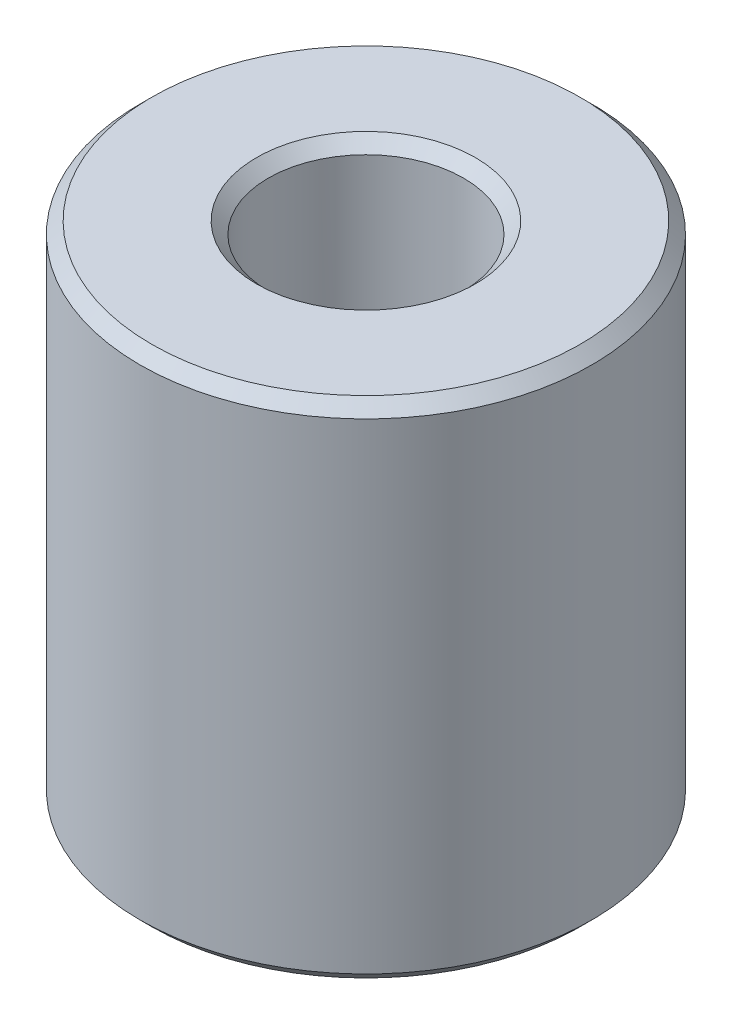
ISO-10303-21;
HEADER;
FILE_DESCRIPTION(('STEP AP214'),'2;1');
FILE_NAME('part.step','',(''),(''),'','','');
FILE_SCHEMA(('AUTOMOTIVE_DESIGN { 1 0 10303 214 1 1 1 1 }'));
ENDSEC;
DATA;
#1=APPLICATION_CONTEXT('core data for automotive mechanical design processes');
#2=APPLICATION_PROTOCOL_DEFINITION('international standard','automotive_design',2000,#1);
#3=PRODUCT_CONTEXT('',#1,'mechanical');
#4=PRODUCT('Part','Part','',(#3));
#5=PRODUCT_RELATED_PRODUCT_CATEGORY('part','',(#4));
#6=PRODUCT_DEFINITION_FORMATION('','',#4);
#7=PRODUCT_DEFINITION_CONTEXT('part definition',#1,'design');
#8=PRODUCT_DEFINITION('design','',#6,#7);
#9=PRODUCT_DEFINITION_SHAPE('','',#8);
#10=(LENGTH_UNIT() NAMED_UNIT(*) SI_UNIT(.MILLI.,.METRE.));
#11=(NAMED_UNIT(*) PLANE_ANGLE_UNIT() SI_UNIT($,.RADIAN.));
#12=(NAMED_UNIT(*) SI_UNIT($,.STERADIAN.) SOLID_ANGLE_UNIT());
#13=UNCERTAINTY_MEASURE_WITH_UNIT(LENGTH_MEASURE(1.E-05),#10,'distance_accuracy_value','');
#14=(GEOMETRIC_REPRESENTATION_CONTEXT(3) GLOBAL_UNCERTAINTY_ASSIGNED_CONTEXT((#13)) GLOBAL_UNIT_ASSIGNED_CONTEXT((#10,
#11,#12)) REPRESENTATION_CONTEXT('',''));
#15=CARTESIAN_POINT('',(0.,0.,0.));
#16=DIRECTION('',(0.,0.,1.));
#17=DIRECTION('',(1.,0.,0.));
#18=AXIS2_PLACEMENT_3D('',#15,#16,#17);
#19=CARTESIAN_POINT('',(0.,33.4799915856072,0.));
#20=DIRECTION('',(0.,-1.,0.));
#21=DIRECTION('',(0.,0.,-1.));
#22=AXIS2_PLACEMENT_3D('',#19,#20,#21);
#23=CYLINDRICAL_SURFACE('',#22,15.);
#24=CARTESIAN_POINT('',(0.,0.785728698125668,0.));
#25=DIRECTION('',(0.,1.,0.));
#26=DIRECTION('',(0.,0.,1.));
#27=AXIS2_PLACEMENT_3D('',#24,#25,#26);
#28=CIRCLE('',#27,15.);
#29=CARTESIAN_POINT('',(0.,0.785728698125668,15.));
#30=VERTEX_POINT('',#29);
#31=EDGE_CURVE('E10',#30,#30,#28,.T.);
#32=ORIENTED_EDGE('',*,*,#31,.T.);
#33=EDGE_LOOP('',(#32));
#34=FACE_BOUND('',#33,.T.);
#35=CARTESIAN_POINT('',(0.,32.6942628874815,0.));
#36=DIRECTION('',(0.,1.,0.));
#37=DIRECTION('',(0.,0.,1.));
#38=AXIS2_PLACEMENT_3D('',#35,#36,#37);
#39=CIRCLE('',#38,15.);
#40=CARTESIAN_POINT('',(0.,32.6942628874815,15.));
#41=VERTEX_POINT('',#40);
#42=EDGE_CURVE('E50',#41,#41,#39,.F.);
#43=ORIENTED_EDGE('',*,*,#42,.T.);
#44=EDGE_LOOP('',(#43));
#45=FACE_BOUND('',#44,.T.);
#46=ADVANCED_FACE('F39',(#34,#45),#23,.T.);
#47=CARTESIAN_POINT('',(0.,33.4799915856072,0.));
#48=DIRECTION('',(0.,1.,0.));
#49=DIRECTION('',(0.,0.,1.));
#50=AXIS2_PLACEMENT_3D('',#47,#48,#49);
#51=PLANE('',#50);
#52=CARTESIAN_POINT('',(0.,33.4799915856072,0.));
#53=DIRECTION('',(0.,1.,0.));
#54=DIRECTION('',(0.,0.,1.));
#55=AXIS2_PLACEMENT_3D('',#52,#53,#54);
#56=CIRCLE('',#55,7.26731428552265);
#57=CARTESIAN_POINT('',(0.,33.4799915856072,7.26731428552265));
#58=VERTEX_POINT('',#57);
#59=EDGE_CURVE('E58',#58,#58,#56,.F.);
#60=ORIENTED_EDGE('',*,*,#59,.T.);
#61=EDGE_LOOP('',(#60));
#62=FACE_BOUND('',#61,.T.);
#63=CARTESIAN_POINT('',(0.,33.4799915856072,0.));
#64=DIRECTION('',(0.,1.,0.));
#65=DIRECTION('',(0.,0.,1.));
#66=AXIS2_PLACEMENT_3D('',#63,#64,#65);
#67=CIRCLE('',#66,14.2142713018743);
#68=CARTESIAN_POINT('',(0.,33.4799915856072,14.2142713018743));
#69=VERTEX_POINT('',#68);
#70=EDGE_CURVE('E61',#69,#69,#67,.T.);
#71=ORIENTED_EDGE('',*,*,#70,.T.);
#72=EDGE_LOOP('',(#71));
#73=FACE_BOUND('',#72,.T.);
#74=ADVANCED_FACE('F88',(#62,#73),#51,.T.);
#75=CARTESIAN_POINT('',(0.,0.,0.));
#76=DIRECTION('',(0.,1.,0.));
#77=DIRECTION('',(0.,0.,1.));
#78=AXIS2_PLACEMENT_3D('',#75,#76,#77);
#79=PLANE('',#78);
#80=CARTESIAN_POINT('',(0.,0.,0.));
#81=DIRECTION('',(0.,1.,0.));
#82=DIRECTION('',(0.,0.,1.));
#83=AXIS2_PLACEMENT_3D('',#80,#81,#82);
#84=CIRCLE('',#83,7.26731428552266);
#85=CARTESIAN_POINT('',(0.,0.,-7.26731428552266));
#86=VERTEX_POINT('',#85);
#87=EDGE_CURVE('E51',#86,#86,#84,.T.);
#88=ORIENTED_EDGE('',*,*,#87,.T.);
#89=EDGE_LOOP('',(#88));
#90=FACE_BOUND('',#89,.T.);
#91=CARTESIAN_POINT('',(0.,0.,0.));
#92=DIRECTION('',(0.,1.,0.));
#93=DIRECTION('',(0.,0.,1.));
#94=AXIS2_PLACEMENT_3D('',#91,#92,#93);
#95=CIRCLE('',#94,14.2142713018743);
#96=CARTESIAN_POINT('',(0.,0.,14.2142713018743));
#97=VERTEX_POINT('',#96);
#98=EDGE_CURVE('E54',#97,#97,#95,.F.);
#99=ORIENTED_EDGE('',*,*,#98,.T.);
#100=EDGE_LOOP('',(#99));
#101=FACE_BOUND('',#100,.T.);
#102=ADVANCED_FACE('F83',(#90,#101),#79,.F.);
#103=CARTESIAN_POINT('',(0.,33.4799915856072,0.));
#104=DIRECTION('',(0.,-1.,0.));
#105=DIRECTION('',(0.,0.,-1.));
#106=AXIS2_PLACEMENT_3D('',#103,#104,#105);
#107=CYLINDRICAL_SURFACE('',#106,6.48158558739699);
#108=CARTESIAN_POINT('',(0.,32.6942628874815,0.));
#109=DIRECTION('',(0.,1.,0.));
#110=DIRECTION('',(0.,0.,1.));
#111=AXIS2_PLACEMENT_3D('',#108,#109,#110);
#112=CIRCLE('',#111,6.48158558739699);
#113=CARTESIAN_POINT('',(0.,32.6942628874815,6.48158558739699));
#114=VERTEX_POINT('',#113);
#115=EDGE_CURVE('E67',#114,#114,#112,.T.);
#116=ORIENTED_EDGE('',*,*,#115,.T.);
#117=EDGE_LOOP('',(#116));
#118=FACE_BOUND('',#117,.T.);
#119=CARTESIAN_POINT('',(0.,0.785728698125675,0.));
#120=DIRECTION('',(0.,1.,0.));
#121=DIRECTION('',(0.,0.,1.));
#122=AXIS2_PLACEMENT_3D('',#119,#120,#121);
#123=CIRCLE('',#122,6.48158558739699);
#124=CARTESIAN_POINT('',(0.,0.785728698125675,-6.48158558739699));
#125=VERTEX_POINT('',#124);
#126=EDGE_CURVE('E69',#125,#125,#123,.F.);
#127=ORIENTED_EDGE('',*,*,#126,.T.);
#128=EDGE_LOOP('',(#127));
#129=FACE_BOUND('',#128,.T.);
#130=ADVANCED_FACE('F71',(#118,#129),#107,.F.);
#131=CARTESIAN_POINT('',(0.,32.6942628874815,0.));
#132=DIRECTION('',(0.,1.,0.));
#133=DIRECTION('',(0.,0.,1.));
#134=AXIS2_PLACEMENT_3D('',#131,#132,#133);
#135=CONICAL_SURFACE('',#134,6.48158558739699,0.785398163397449);
#136=ORIENTED_EDGE('',*,*,#59,.F.);
#137=EDGE_LOOP('',(#136));
#138=FACE_BOUND('',#137,.T.);
#139=ORIENTED_EDGE('',*,*,#115,.F.);
#140=EDGE_LOOP('',(#139));
#141=FACE_BOUND('',#140,.T.);
#142=ADVANCED_FACE('F77',(#138,#141),#135,.F.);
#143=CARTESIAN_POINT('',(0.,0.,0.));
#144=DIRECTION('',(0.,-1.,0.));
#145=DIRECTION('',(0.,0.,-1.));
#146=AXIS2_PLACEMENT_3D('',#143,#144,#145);
#147=CONICAL_SURFACE('',#146,7.26731428552266,0.785398163397445);
#148=CARTESIAN_POINT('',(0.,0.785728698125675,-6.48158558739699));
#149=CARTESIAN_POINT('',(0.,0.777544024186866,-6.4897702613358));
#150=CARTESIAN_POINT('',(0.,0.769359350248057,-6.49795493527461));
#151=CARTESIAN_POINT('',(0.,0.752990002370438,-6.51432428315223));
#152=CARTESIAN_POINT('',(0.,0.744805328431629,-6.52250895709104));
#153=CARTESIAN_POINT('',(0.,0.728435980554011,-6.53887830496865));
#154=CARTESIAN_POINT('',(0.,0.720251306615202,-6.54706297890746));
#155=CARTESIAN_POINT('',(0.,0.703881958737584,-6.56343232678508));
#156=CARTESIAN_POINT('',(0.,0.695697284798774,-6.57161700072389));
#157=CARTESIAN_POINT('',(0.,0.679327936921156,-6.58798634860151));
#158=CARTESIAN_POINT('',(0.,0.671143262982347,-6.59617102254032));
#159=CARTESIAN_POINT('',(0.,0.654773915104729,-6.61254037041793));
#160=CARTESIAN_POINT('',(0.,0.64658924116592,-6.62072504435674));
#161=CARTESIAN_POINT('',(0.,0.630219893288301,-6.63709439223436));
#162=CARTESIAN_POINT('',(0.,0.622035219349492,-6.64527906617317));
#163=CARTESIAN_POINT('',(0.,0.605665871471874,-6.66164841405079));
#164=CARTESIAN_POINT('',(0.,0.597481197533065,-6.6698330879896));
#165=CARTESIAN_POINT('',(0.,0.581111849655447,-6.68620243586722));
#166=CARTESIAN_POINT('',(0.,0.572927175716638,-6.69438710980602));
#167=CARTESIAN_POINT('',(0.,0.556557827839019,-6.71075645768364));
#168=CARTESIAN_POINT('',(0.,0.54837315390021,-6.71894113162245));
#169=CARTESIAN_POINT('',(0.,0.532003806022592,-6.73531047950007));
#170=CARTESIAN_POINT('',(0.,0.523819132083783,-6.74349515343888));
#171=CARTESIAN_POINT('',(0.,0.507449784206165,-6.7598645013165));
#172=CARTESIAN_POINT('',(0.,0.499265110267356,-6.76804917525531));
#173=CARTESIAN_POINT('',(0.,0.482895762389738,-6.78441852313292));
#174=CARTESIAN_POINT('',(0.,0.474711088450928,-6.79260319707173));
#175=CARTESIAN_POINT('',(0.,0.45834174057331,-6.80897254494935));
#176=CARTESIAN_POINT('',(0.,0.450157066634501,-6.81715721888816));
#177=CARTESIAN_POINT('',(0.,0.433787718756883,-6.83352656676578));
#178=CARTESIAN_POINT('',(0.,0.425603044818074,-6.84171124070459));
#179=CARTESIAN_POINT('',(0.,0.409233696940455,-6.85808058858221));
#180=CARTESIAN_POINT('',(0.,0.401049023001646,-6.86626526252101));
#181=CARTESIAN_POINT('',(0.,0.384679675124028,-6.88263461039863));
#182=CARTESIAN_POINT('',(0.,0.376495001185219,-6.89081928433744));
#183=CARTESIAN_POINT('',(0.,0.360125653307601,-6.90718863221506));
#184=CARTESIAN_POINT('',(0.,0.351940979368792,-6.91537330615387));
#185=CARTESIAN_POINT('',(0.,0.335571631491173,-6.93174265403149));
#186=CARTESIAN_POINT('',(0.,0.327386957552364,-6.9399273279703));
#187=CARTESIAN_POINT('',(0.,0.311017609674746,-6.95629667584791));
#188=CARTESIAN_POINT('',(0.,0.302832935735937,-6.96448134978672));
#189=CARTESIAN_POINT('',(0.,0.286463587858319,-6.98085069766434));
#190=CARTESIAN_POINT('',(0.,0.27827891391951,-6.98903537160315));
#191=CARTESIAN_POINT('',(0.,0.261909566041892,-7.00540471948077));
#192=CARTESIAN_POINT('',(0.,0.253724892103082,-7.01358939341958));
#193=CARTESIAN_POINT('',(0.,0.237355544225464,-7.0299587412972));
#194=CARTESIAN_POINT('',(0.,0.229170870286655,-7.03814341523601));
#195=CARTESIAN_POINT('',(0.,0.212801522409037,-7.05451276311362));
#196=CARTESIAN_POINT('',(0.,0.204616848470228,-7.06269743705243));
#197=CARTESIAN_POINT('',(0.,0.188247500592609,-7.07906678493005));
#198=CARTESIAN_POINT('',(0.,0.1800628266538,-7.08725145886886));
#199=CARTESIAN_POINT('',(0.,0.163693478776182,-7.10362080674648));
#200=CARTESIAN_POINT('',(0.,0.155508804837373,-7.11180548068529));
#201=CARTESIAN_POINT('',(0.,0.139139456959755,-7.1281748285629));
#202=CARTESIAN_POINT('',(0.,0.130954783020946,-7.13635950250171));
#203=CARTESIAN_POINT('',(0.,0.114585435143327,-7.15272885037933));
#204=CARTESIAN_POINT('',(0.,0.106400761204519,-7.16091352431814));
#205=CARTESIAN_POINT('',(0.,0.0900314133269003,-7.17728287219576));
#206=CARTESIAN_POINT('',(0.,0.081846739388091,-7.18546754613457));
#207=CARTESIAN_POINT('',(0.,0.0654773915104728,-7.20183689401219));
#208=CARTESIAN_POINT('',(0.,0.0572927175716638,-7.210021567951));
#209=CARTESIAN_POINT('',(0.,0.0409233696940457,-7.22639091582861));
#210=CARTESIAN_POINT('',(0.,0.0327386957552365,-7.23457558976742));
#211=CARTESIAN_POINT('',(0.,0.0163693478776181,-7.25094493764504));
#212=CARTESIAN_POINT('',(0.,0.00818467393880886,-7.25912961158385));
#213=CARTESIAN_POINT('',(0.,0.,-7.26731428552266));
#214=B_SPLINE_CURVE_WITH_KNOTS('',3,(#148,#149,#150,#151,#152,#153,#154,#155,#156,#157,#158,
#159,#160,#161,#162,#163,#164,#165,#166,#167,#168,#169,#170,#171,#172,#173,#174,#175,#176,#177,
#178,#179,#180,#181,#182,#183,#184,#185,#186,#187,#188,#189,#190,#191,#192,#193,#194,#195,#196,
#197,#198,#199,#200,#201,#202,#203,#204,#205,#206,#207,#208,#209,#210,#211,#212,#213),
.UNSPECIFIED.,.F.,.F.,(4,2,2,2,2,2,2,2,2,2,2,2,2,2,2,2,2,2,2,2,2,2,2,2,2,2,2,2,2,2,2,2,4),(0.,
0.0347246306635966,0.0694492613271925,0.104173891990789,0.138898522654385,0.173623153317982,
0.208347783981577,0.243072414645174,0.277797045308771,0.312521675972366,0.347246306635963,
0.381970937299559,0.416695567963156,0.451420198626751,0.486144829290348,0.520869459953944,
0.555594090617541,0.590318721281137,0.625043351944733,0.659767982608329,0.694492613271925,
0.729217243935522,0.763941874599118,0.798666505262714,0.83339113592631,0.868115766589907,
0.902840397253503,0.937565027917099,0.972289658580696,1.00701428924429,1.04173891990789,
1.07646355057148,1.11118818123508),.UNSPECIFIED.);
#215=EDGE_CURVE('BSEAM73',#125,#86,#214,.T.);
#216=ORIENTED_EDGE('',*,*,#126,.F.);
#217=ORIENTED_EDGE('',*,*,#87,.F.);
#218=ORIENTED_EDGE('',*,*,#215,.T.);
#219=ORIENTED_EDGE('',*,*,#215,.F.);
#220=EDGE_LOOP('',(#216,#218,#217,#219));
#221=FACE_BOUND('',#220,.T.);
#222=ADVANCED_FACE('F73',(#221),#147,.F.);
#223=CARTESIAN_POINT('',(0.,0.785728698125668,0.));
#224=DIRECTION('',(0.,1.,0.));
#225=DIRECTION('',(0.,0.,1.));
#226=AXIS2_PLACEMENT_3D('',#223,#224,#225);
#227=CONICAL_SURFACE('',#226,15.,0.785398163397453);
#228=ORIENTED_EDGE('',*,*,#98,.F.);
#229=EDGE_LOOP('',(#228));
#230=FACE_BOUND('',#229,.T.);
#231=ORIENTED_EDGE('',*,*,#31,.F.);
#232=EDGE_LOOP('',(#231));
#233=FACE_BOUND('',#232,.T.);
#234=ADVANCED_FACE('F76',(#230,#233),#227,.T.);
#235=CARTESIAN_POINT('',(0.,33.4799915856072,0.));
#236=DIRECTION('',(0.,-1.,0.));
#237=DIRECTION('',(0.,0.,-1.));
#238=AXIS2_PLACEMENT_3D('',#235,#236,#237);
#239=CONICAL_SURFACE('',#238,14.2142713018743,0.785398163397444);
#240=ORIENTED_EDGE('',*,*,#42,.F.);
#241=EDGE_LOOP('',(#240));
#242=FACE_BOUND('',#241,.T.);
#243=ORIENTED_EDGE('',*,*,#70,.F.);
#244=EDGE_LOOP('',(#243));
#245=FACE_BOUND('',#244,.T.);
#246=ADVANCED_FACE('F45',(#242,#245),#239,.T.);
#247=CLOSED_SHELL('',(#46,#74,#102,#130,#142,#222,#234,#246));
#248=MANIFOLD_SOLID_BREP('B2',#247);
#249=ADVANCED_BREP_SHAPE_REPRESENTATION('',(#18,#248),#14);
#250=SHAPE_DEFINITION_REPRESENTATION(#9,#249);
ENDSEC;
END-ISO-10303-21;
